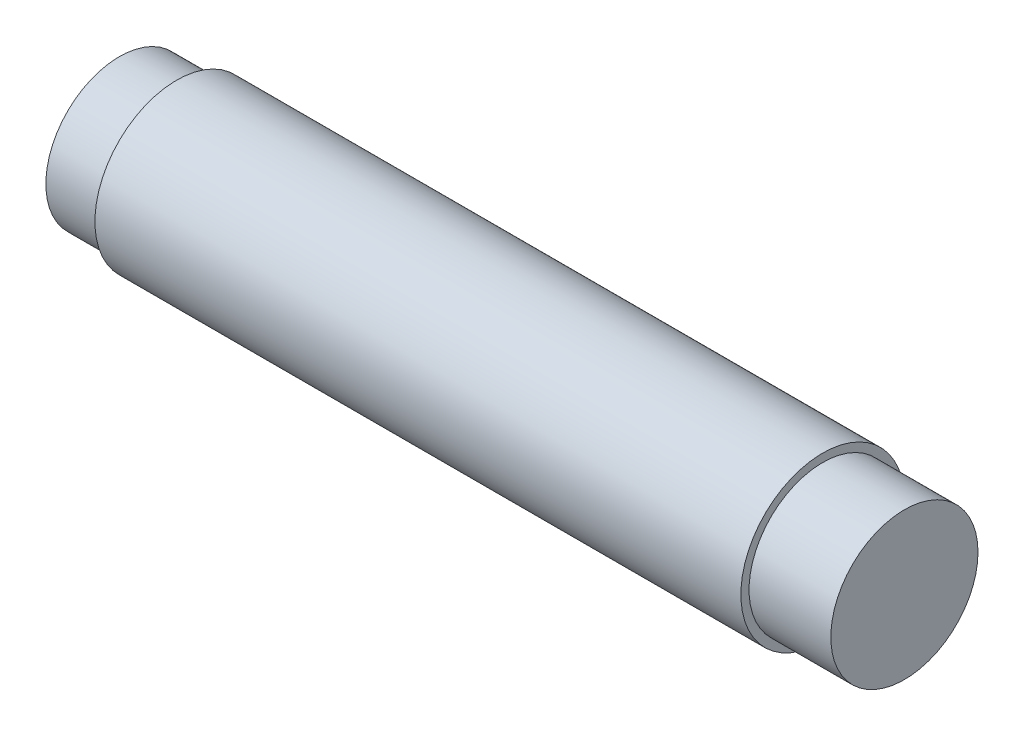
ISO-10303-21;
HEADER;
FILE_DESCRIPTION(('STEP AP214'),'2;1');
FILE_NAME('part.step','',(''),(''),'','','');
FILE_SCHEMA(('AUTOMOTIVE_DESIGN { 1 0 10303 214 1 1 1 1 }'));
ENDSEC;
DATA;
#1=APPLICATION_CONTEXT('core data for automotive mechanical design processes');
#2=APPLICATION_PROTOCOL_DEFINITION('international standard','automotive_design',2000,#1);
#3=PRODUCT_CONTEXT('',#1,'mechanical');
#4=PRODUCT('Part','Part','',(#3));
#5=PRODUCT_RELATED_PRODUCT_CATEGORY('part','',(#4));
#6=PRODUCT_DEFINITION_FORMATION('','',#4);
#7=PRODUCT_DEFINITION_CONTEXT('part definition',#1,'design');
#8=PRODUCT_DEFINITION('design','',#6,#7);
#9=PRODUCT_DEFINITION_SHAPE('','',#8);
#10=(LENGTH_UNIT() NAMED_UNIT(*) SI_UNIT(.MILLI.,.METRE.));
#11=(NAMED_UNIT(*) PLANE_ANGLE_UNIT() SI_UNIT($,.RADIAN.));
#12=(NAMED_UNIT(*) SI_UNIT($,.STERADIAN.) SOLID_ANGLE_UNIT());
#13=UNCERTAINTY_MEASURE_WITH_UNIT(LENGTH_MEASURE(1.E-05),#10,'distance_accuracy_value','');
#14=(GEOMETRIC_REPRESENTATION_CONTEXT(3) GLOBAL_UNCERTAINTY_ASSIGNED_CONTEXT((#13)) GLOBAL_UNIT_ASSIGNED_CONTEXT((#10,
#11,#12)) REPRESENTATION_CONTEXT('',''));
#15=CARTESIAN_POINT('',(0.,0.,0.));
#16=DIRECTION('',(0.,0.,1.));
#17=DIRECTION('',(1.,0.,0.));
#18=AXIS2_PLACEMENT_3D('',#15,#16,#17);
#19=CARTESIAN_POINT('',(-20.5,0.,0.));
#20=DIRECTION('',(1.,0.,0.));
#21=DIRECTION('',(0.,0.,-1.));
#22=AXIS2_PLACEMENT_3D('',#19,#20,#21);
#23=CYLINDRICAL_SURFACE('',#22,5.);
#24=CARTESIAN_POINT('',(-20.5,0.,0.));
#25=DIRECTION('',(1.,0.,0.));
#26=DIRECTION('',(0.,0.,-1.));
#27=AXIS2_PLACEMENT_3D('',#24,#25,#26);
#28=CIRCLE('',#27,5.);
#29=CARTESIAN_POINT('',(-20.5,0.,-5.));
#30=VERTEX_POINT('',#29);
#31=EDGE_CURVE('E10',#30,#30,#28,.T.);
#32=ORIENTED_EDGE('',*,*,#31,.T.);
#33=EDGE_LOOP('',(#32));
#34=FACE_BOUND('',#33,.T.);
#35=CARTESIAN_POINT('',(19.,0.,0.));
#36=DIRECTION('',(1.,0.,0.));
#37=DIRECTION('',(0.,0.,-1.));
#38=AXIS2_PLACEMENT_3D('',#35,#36,#37);
#39=CIRCLE('',#38,5.);
#40=CARTESIAN_POINT('',(19.,0.,-5.));
#41=VERTEX_POINT('',#40);
#42=EDGE_CURVE('E48',#41,#41,#39,.T.);
#43=ORIENTED_EDGE('',*,*,#42,.F.);
#44=EDGE_LOOP('',(#43));
#45=FACE_BOUND('',#44,.T.);
#46=ADVANCED_FACE('F41',(#34,#45),#23,.T.);
#47=CARTESIAN_POINT('',(-20.5,0.,0.));
#48=DIRECTION('',(1.,0.,0.));
#49=DIRECTION('',(0.,0.,-1.));
#50=AXIS2_PLACEMENT_3D('',#47,#48,#49);
#51=PLANE('',#50);
#52=CARTESIAN_POINT('',(-20.5,0.,0.));
#53=DIRECTION('',(1.,0.,0.));
#54=DIRECTION('',(0.,0.,-1.));
#55=AXIS2_PLACEMENT_3D('',#52,#53,#54);
#56=CIRCLE('',#55,4.5);
#57=CARTESIAN_POINT('',(-20.5,0.,-4.5));
#58=VERTEX_POINT('',#57);
#59=EDGE_CURVE('E44',#58,#58,#56,.T.);
#60=ORIENTED_EDGE('',*,*,#59,.T.);
#61=EDGE_LOOP('',(#60));
#62=FACE_BOUND('',#61,.T.);
#63=ORIENTED_EDGE('',*,*,#31,.F.);
#64=EDGE_LOOP('',(#63));
#65=FACE_BOUND('',#64,.T.);
#66=ADVANCED_FACE('F67',(#62,#65),#51,.F.);
#67=CARTESIAN_POINT('',(19.,0.,0.));
#68=DIRECTION('',(1.,0.,0.));
#69=DIRECTION('',(0.,0.,-1.));
#70=AXIS2_PLACEMENT_3D('',#67,#68,#69);
#71=PLANE('',#70);
#72=CARTESIAN_POINT('',(19.,0.,0.));
#73=DIRECTION('',(1.,0.,0.));
#74=DIRECTION('',(0.,0.,-1.));
#75=AXIS2_PLACEMENT_3D('',#72,#73,#74);
#76=CIRCLE('',#75,4.5);
#77=CARTESIAN_POINT('',(19.,0.,-4.5));
#78=VERTEX_POINT('',#77);
#79=EDGE_CURVE('E55',#78,#78,#76,.T.);
#80=ORIENTED_EDGE('',*,*,#79,.F.);
#81=EDGE_LOOP('',(#80));
#82=FACE_BOUND('',#81,.T.);
#83=ORIENTED_EDGE('',*,*,#42,.T.);
#84=EDGE_LOOP('',(#83));
#85=FACE_BOUND('',#84,.T.);
#86=ADVANCED_FACE('F89',(#82,#85),#71,.T.);
#87=CARTESIAN_POINT('',(24.,0.,0.));
#88=DIRECTION('',(-1.,0.,0.));
#89=DIRECTION('',(0.,0.,1.));
#90=AXIS2_PLACEMENT_3D('',#87,#88,#89);
#91=CYLINDRICAL_SURFACE('',#90,4.5);
#92=CARTESIAN_POINT('',(24.,0.,0.));
#93=DIRECTION('',(1.,0.,0.));
#94=DIRECTION('',(0.,0.,-1.));
#95=AXIS2_PLACEMENT_3D('',#92,#93,#94);
#96=CIRCLE('',#95,4.5);
#97=CARTESIAN_POINT('',(24.,0.,-4.5));
#98=VERTEX_POINT('',#97);
#99=EDGE_CURVE('E52',#98,#98,#96,.T.);
#100=ORIENTED_EDGE('',*,*,#99,.F.);
#101=EDGE_LOOP('',(#100));
#102=FACE_BOUND('',#101,.T.);
#103=ORIENTED_EDGE('',*,*,#79,.T.);
#104=EDGE_LOOP('',(#103));
#105=FACE_BOUND('',#104,.T.);
#106=ADVANCED_FACE('F82',(#102,#105),#91,.T.);
#107=CARTESIAN_POINT('',(24.,0.,0.));
#108=DIRECTION('',(1.,0.,0.));
#109=DIRECTION('',(0.,0.,-1.));
#110=AXIS2_PLACEMENT_3D('',#107,#108,#109);
#111=PLANE('',#110);
#112=ORIENTED_EDGE('',*,*,#99,.T.);
#113=EDGE_LOOP('',(#112));
#114=FACE_BOUND('',#113,.T.);
#115=ADVANCED_FACE('F73',(#114),#111,.T.);
#116=CARTESIAN_POINT('',(-24.,0.,0.));
#117=DIRECTION('',(1.,0.,0.));
#118=DIRECTION('',(0.,0.,-1.));
#119=AXIS2_PLACEMENT_3D('',#116,#117,#118);
#120=CYLINDRICAL_SURFACE('',#119,4.5);
#121=CARTESIAN_POINT('',(-24.,0.,0.));
#122=DIRECTION('',(1.,0.,0.));
#123=DIRECTION('',(0.,0.,-1.));
#124=AXIS2_PLACEMENT_3D('',#121,#122,#123);
#125=CIRCLE('',#124,4.5);
#126=CARTESIAN_POINT('',(-24.,0.,-4.5));
#127=VERTEX_POINT('',#126);
#128=EDGE_CURVE('E60',#127,#127,#125,.T.);
#129=ORIENTED_EDGE('',*,*,#128,.T.);
#130=EDGE_LOOP('',(#129));
#131=FACE_BOUND('',#130,.T.);
#132=ORIENTED_EDGE('',*,*,#59,.F.);
#133=EDGE_LOOP('',(#132));
#134=FACE_BOUND('',#133,.T.);
#135=ADVANCED_FACE('F70',(#131,#134),#120,.T.);
#136=CARTESIAN_POINT('',(-24.,0.,0.));
#137=DIRECTION('',(-1.,0.,0.));
#138=DIRECTION('',(0.,0.,-1.));
#139=AXIS2_PLACEMENT_3D('',#136,#137,#138);
#140=PLANE('',#139);
#141=ORIENTED_EDGE('',*,*,#128,.F.);
#142=EDGE_LOOP('',(#141));
#143=FACE_BOUND('',#142,.T.);
#144=ADVANCED_FACE('F72',(#143),#140,.T.);
#145=CLOSED_SHELL('',(#46,#66,#86,#106,#115,#135,#144));
#146=MANIFOLD_SOLID_BREP('B2',#145);
#147=ADVANCED_BREP_SHAPE_REPRESENTATION('',(#18,#146),#14);
#148=SHAPE_DEFINITION_REPRESENTATION(#9,#147);
ENDSEC;
END-ISO-10303-21;
